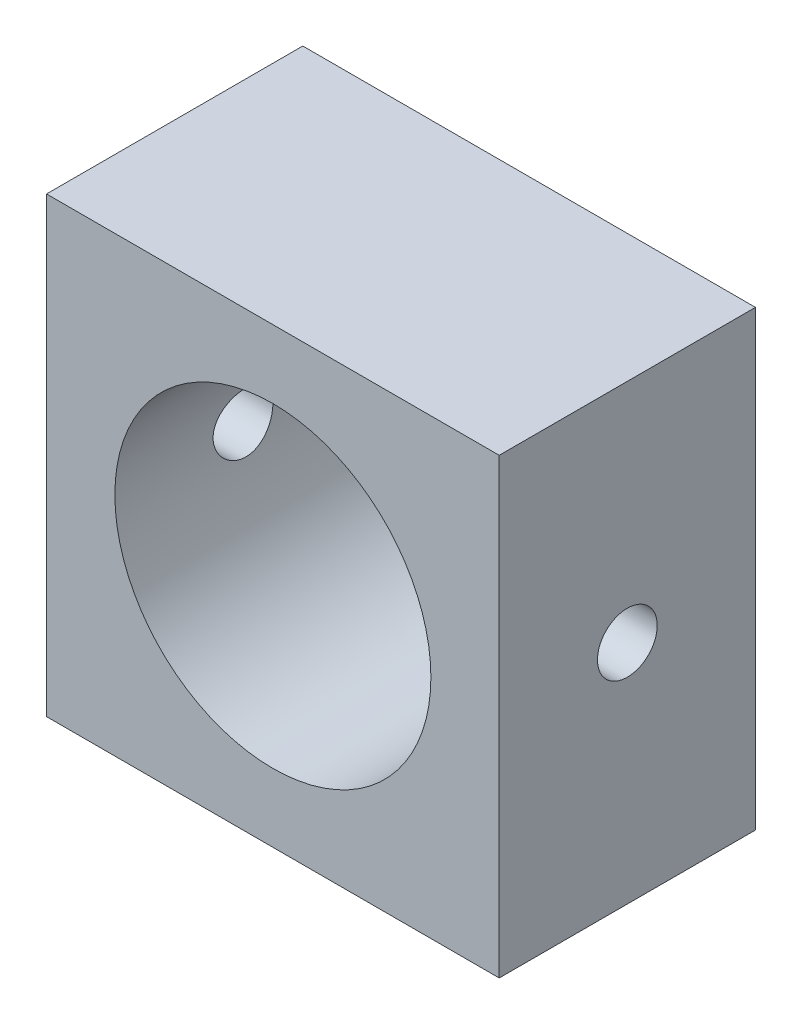
ISO-10303-21;
HEADER;
FILE_DESCRIPTION(('STEP AP214'),'2;1');
FILE_NAME('part.step','',(''),(''),'','','');
FILE_SCHEMA(('AUTOMOTIVE_DESIGN { 1 0 10303 214 1 1 1 1 }'));
ENDSEC;
DATA;
#1=APPLICATION_CONTEXT('core data for automotive mechanical design processes');
#2=APPLICATION_PROTOCOL_DEFINITION('international standard','automotive_design',2000,#1);
#3=PRODUCT_CONTEXT('',#1,'mechanical');
#4=PRODUCT('Part','Part','',(#3));
#5=PRODUCT_RELATED_PRODUCT_CATEGORY('part','',(#4));
#6=PRODUCT_DEFINITION_FORMATION('','',#4);
#7=PRODUCT_DEFINITION_CONTEXT('part definition',#1,'design');
#8=PRODUCT_DEFINITION('design','',#6,#7);
#9=PRODUCT_DEFINITION_SHAPE('','',#8);
#10=(LENGTH_UNIT() NAMED_UNIT(*) SI_UNIT(.MILLI.,.METRE.));
#11=(NAMED_UNIT(*) PLANE_ANGLE_UNIT() SI_UNIT($,.RADIAN.));
#12=(NAMED_UNIT(*) SI_UNIT($,.STERADIAN.) SOLID_ANGLE_UNIT());
#13=UNCERTAINTY_MEASURE_WITH_UNIT(LENGTH_MEASURE(1.E-05),#10,'distance_accuracy_value','');
#14=(GEOMETRIC_REPRESENTATION_CONTEXT(3) GLOBAL_UNCERTAINTY_ASSIGNED_CONTEXT((#13)) GLOBAL_UNIT_ASSIGNED_CONTEXT((#10,
#11,#12)) REPRESENTATION_CONTEXT('',''));
#15=CARTESIAN_POINT('',(0.,0.,0.));
#16=DIRECTION('',(0.,0.,1.));
#17=DIRECTION('',(1.,0.,0.));
#18=AXIS2_PLACEMENT_3D('',#15,#16,#17);
#19=CARTESIAN_POINT('',(0.,0.,7.5));
#20=DIRECTION('',(0.,0.,1.));
#21=DIRECTION('',(1.,0.,0.));
#22=AXIS2_PLACEMENT_3D('',#19,#20,#21);
#23=PLANE('',#22);
#24=DIRECTION('',(0.,1.,0.));
#25=VECTOR('',#24,1.);
#26=CARTESIAN_POINT('',(13.25,13.25,7.5));
#27=LINE('',#26,#25);
#28=CARTESIAN_POINT('',(13.25,-13.25,7.5));
#29=VERTEX_POINT('',#28);
#30=CARTESIAN_POINT('',(13.25,13.25,7.5));
#31=VERTEX_POINT('',#30);
#32=EDGE_CURVE('E92',#29,#31,#27,.T.);
#33=ORIENTED_EDGE('',*,*,#32,.T.);
#34=DIRECTION('',(-1.,0.,0.));
#35=VECTOR('',#34,1.);
#36=CARTESIAN_POINT('',(-13.25,13.25,7.5));
#37=LINE('',#36,#35);
#38=CARTESIAN_POINT('',(-13.25,13.25,7.5));
#39=VERTEX_POINT('',#38);
#40=EDGE_CURVE('E87',#31,#39,#37,.T.);
#41=ORIENTED_EDGE('',*,*,#40,.T.);
#42=DIRECTION('',(0.,-1.,0.));
#43=VECTOR('',#42,1.);
#44=CARTESIAN_POINT('',(-13.25,13.25,7.5));
#45=LINE('',#44,#43);
#46=CARTESIAN_POINT('',(-13.25,-13.25,7.5));
#47=VERTEX_POINT('',#46);
#48=EDGE_CURVE('E90',#39,#47,#45,.T.);
#49=ORIENTED_EDGE('',*,*,#48,.T.);
#50=DIRECTION('',(1.,0.,0.));
#51=VECTOR('',#50,1.);
#52=CARTESIAN_POINT('',(-13.25,-13.25,7.5));
#53=LINE('',#52,#51);
#54=EDGE_CURVE('E57',#47,#29,#53,.T.);
#55=ORIENTED_EDGE('',*,*,#54,.T.);
#56=EDGE_LOOP('',(#33,#41,#49,#55));
#57=FACE_BOUND('',#56,.T.);
#58=CARTESIAN_POINT('',(0.,0.,7.5));
#59=DIRECTION('',(0.,0.,1.));
#60=DIRECTION('',(1.,0.,0.));
#61=AXIS2_PLACEMENT_3D('',#58,#59,#60);
#62=CIRCLE('',#61,9.25);
#63=CARTESIAN_POINT('',(9.25,0.,7.5));
#64=VERTEX_POINT('',#63);
#65=EDGE_CURVE('E108',#64,#64,#62,.T.);
#66=ORIENTED_EDGE('',*,*,#65,.F.);
#67=EDGE_LOOP('',(#66));
#68=FACE_BOUND('',#67,.T.);
#69=ADVANCED_FACE('F33',(#57,#68),#23,.T.);
#70=CARTESIAN_POINT('',(0.,0.,-7.5));
#71=DIRECTION('',(0.,0.,1.));
#72=DIRECTION('',(1.,0.,0.));
#73=AXIS2_PLACEMENT_3D('',#70,#71,#72);
#74=PLANE('',#73);
#75=DIRECTION('',(0.,1.,0.));
#76=VECTOR('',#75,1.);
#77=CARTESIAN_POINT('',(13.25,13.25,-7.5));
#78=LINE('',#77,#76);
#79=CARTESIAN_POINT('',(13.25,-13.25,-7.5));
#80=VERTEX_POINT('',#79);
#81=CARTESIAN_POINT('',(13.25,13.25,-7.5));
#82=VERTEX_POINT('',#81);
#83=EDGE_CURVE('E105',#80,#82,#78,.T.);
#84=ORIENTED_EDGE('',*,*,#83,.F.);
#85=DIRECTION('',(1.,0.,0.));
#86=VECTOR('',#85,1.);
#87=CARTESIAN_POINT('',(-13.25,-13.25,-7.5));
#88=LINE('',#87,#86);
#89=CARTESIAN_POINT('',(-13.25,-13.25,-7.5));
#90=VERTEX_POINT('',#89);
#91=EDGE_CURVE('E80',#90,#80,#88,.T.);
#92=ORIENTED_EDGE('',*,*,#91,.F.);
#93=DIRECTION('',(0.,-1.,0.));
#94=VECTOR('',#93,1.);
#95=CARTESIAN_POINT('',(-13.25,13.25,-7.5));
#96=LINE('',#95,#94);
#97=CARTESIAN_POINT('',(-13.25,13.25,-7.5));
#98=VERTEX_POINT('',#97);
#99=EDGE_CURVE('E74',#98,#90,#96,.T.);
#100=ORIENTED_EDGE('',*,*,#99,.F.);
#101=DIRECTION('',(-1.,0.,0.));
#102=VECTOR('',#101,1.);
#103=CARTESIAN_POINT('',(-13.25,13.25,-7.5));
#104=LINE('',#103,#102);
#105=EDGE_CURVE('E96',#82,#98,#104,.T.);
#106=ORIENTED_EDGE('',*,*,#105,.F.);
#107=EDGE_LOOP('',(#84,#92,#100,#106));
#108=FACE_BOUND('',#107,.T.);
#109=CARTESIAN_POINT('',(0.,0.,-7.5));
#110=DIRECTION('',(0.,0.,1.));
#111=DIRECTION('',(1.,0.,0.));
#112=AXIS2_PLACEMENT_3D('',#109,#110,#111);
#113=CIRCLE('',#112,9.25);
#114=CARTESIAN_POINT('',(9.25,0.,-7.5));
#115=VERTEX_POINT('',#114);
#116=EDGE_CURVE('E163',#115,#115,#113,.T.);
#117=ORIENTED_EDGE('',*,*,#116,.T.);
#118=EDGE_LOOP('',(#117));
#119=FACE_BOUND('',#118,.T.);
#120=ADVANCED_FACE('F137',(#108,#119),#74,.F.);
#121=CARTESIAN_POINT('',(13.25,13.25,7.5));
#122=DIRECTION('',(-1.,0.,0.));
#123=DIRECTION('',(0.,0.,1.));
#124=AXIS2_PLACEMENT_3D('',#121,#122,#123);
#125=PLANE('',#124);
#126=CARTESIAN_POINT('',(13.25,0.,0.));
#127=DIRECTION('',(1.,0.,0.));
#128=DIRECTION('',(0.,0.,-1.));
#129=AXIS2_PLACEMENT_3D('',#126,#127,#128);
#130=CIRCLE('',#129,1.75);
#131=CARTESIAN_POINT('',(13.25,0.,-1.75));
#132=VERTEX_POINT('',#131);
#133=EDGE_CURVE('E158',#132,#132,#130,.T.);
#134=ORIENTED_EDGE('',*,*,#133,.F.);
#135=EDGE_LOOP('',(#134));
#136=FACE_BOUND('',#135,.T.);
#137=ORIENTED_EDGE('',*,*,#83,.T.);
#138=DIRECTION('',(0.,0.,-1.));
#139=VECTOR('',#138,1.);
#140=CARTESIAN_POINT('',(13.25,13.25,7.5));
#141=LINE('',#140,#139);
#142=EDGE_CURVE('E11',#31,#82,#141,.T.);
#143=ORIENTED_EDGE('',*,*,#142,.F.);
#144=ORIENTED_EDGE('',*,*,#32,.F.);
#145=DIRECTION('',(0.,0.,-1.));
#146=VECTOR('',#145,1.);
#147=CARTESIAN_POINT('',(13.25,-13.25,7.5));
#148=LINE('',#147,#146);
#149=EDGE_CURVE('E101',#29,#80,#148,.T.);
#150=ORIENTED_EDGE('',*,*,#149,.T.);
#151=EDGE_LOOP('',(#137,#143,#144,#150));
#152=FACE_BOUND('',#151,.T.);
#153=ADVANCED_FACE('F35',(#136,#152),#125,.F.);
#154=CARTESIAN_POINT('',(-13.25,13.25,7.5));
#155=DIRECTION('',(0.,-1.,0.));
#156=DIRECTION('',(0.,0.,-1.));
#157=AXIS2_PLACEMENT_3D('',#154,#155,#156);
#158=PLANE('',#157);
#159=ORIENTED_EDGE('',*,*,#105,.T.);
#160=DIRECTION('',(0.,0.,-1.));
#161=VECTOR('',#160,1.);
#162=CARTESIAN_POINT('',(-13.25,13.25,7.5));
#163=LINE('',#162,#161);
#164=EDGE_CURVE('E48',#39,#98,#163,.T.);
#165=ORIENTED_EDGE('',*,*,#164,.F.);
#166=ORIENTED_EDGE('',*,*,#40,.F.);
#167=ORIENTED_EDGE('',*,*,#142,.T.);
#168=EDGE_LOOP('',(#159,#165,#166,#167));
#169=FACE_BOUND('',#168,.T.);
#170=ADVANCED_FACE('F95',(#169),#158,.F.);
#171=CARTESIAN_POINT('',(-13.25,13.25,7.5));
#172=DIRECTION('',(1.,0.,0.));
#173=DIRECTION('',(0.,0.,-1.));
#174=AXIS2_PLACEMENT_3D('',#171,#172,#173);
#175=PLANE('',#174);
#176=CARTESIAN_POINT('',(-13.25,0.,0.));
#177=DIRECTION('',(1.,0.,0.));
#178=DIRECTION('',(0.,0.,-1.));
#179=AXIS2_PLACEMENT_3D('',#176,#177,#178);
#180=CIRCLE('',#179,1.75);
#181=CARTESIAN_POINT('',(-13.25,0.,-1.75));
#182=VERTEX_POINT('',#181);
#183=EDGE_CURVE('E118',#182,#182,#180,.T.);
#184=ORIENTED_EDGE('',*,*,#183,.T.);
#185=EDGE_LOOP('',(#184));
#186=FACE_BOUND('',#185,.T.);
#187=ORIENTED_EDGE('',*,*,#99,.T.);
#188=DIRECTION('',(0.,0.,-1.));
#189=VECTOR('',#188,1.);
#190=CARTESIAN_POINT('',(-13.25,-13.25,7.5));
#191=LINE('',#190,#189);
#192=EDGE_CURVE('E97',#47,#90,#191,.T.);
#193=ORIENTED_EDGE('',*,*,#192,.F.);
#194=ORIENTED_EDGE('',*,*,#48,.F.);
#195=ORIENTED_EDGE('',*,*,#164,.T.);
#196=EDGE_LOOP('',(#187,#193,#194,#195));
#197=FACE_BOUND('',#196,.T.);
#198=ADVANCED_FACE('F99',(#186,#197),#175,.F.);
#199=CARTESIAN_POINT('',(-13.25,-13.25,7.5));
#200=DIRECTION('',(0.,1.,0.));
#201=DIRECTION('',(0.,0.,1.));
#202=AXIS2_PLACEMENT_3D('',#199,#200,#201);
#203=PLANE('',#202);
#204=ORIENTED_EDGE('',*,*,#91,.T.);
#205=ORIENTED_EDGE('',*,*,#149,.F.);
#206=ORIENTED_EDGE('',*,*,#54,.F.);
#207=ORIENTED_EDGE('',*,*,#192,.T.);
#208=EDGE_LOOP('',(#204,#205,#206,#207));
#209=FACE_BOUND('',#208,.T.);
#210=ADVANCED_FACE('F133',(#209),#203,.F.);
#211=CARTESIAN_POINT('',(0.,0.,7.5));
#212=DIRECTION('',(0.,0.,-1.));
#213=DIRECTION('',(-1.,0.,0.));
#214=AXIS2_PLACEMENT_3D('',#211,#212,#213);
#215=CYLINDRICAL_SURFACE('',#214,9.25);
#216=CARTESIAN_POINT('',(-9.25,0.,1.75));
#217=CARTESIAN_POINT('',(-9.24999823125548,-0.09736737410686,1.74999629681898));
#218=CARTESIAN_POINT('',(-9.24844677627382,-0.194782746797271,1.74184647915802));
#219=CARTESIAN_POINT('',(-9.24240726812203,-0.386867274099822,1.70948417352548));
#220=CARTESIAN_POINT('',(-9.23791675572853,-0.481534059523615,1.68525823380294));
#221=CARTESIAN_POINT('',(-9.22650133596264,-0.665315772169169,1.62151292171138));
#222=CARTESIAN_POINT('',(-9.21957864523764,-0.75443566796708,1.58200747154169));
#223=CARTESIAN_POINT('',(-9.20405437161695,-0.924774401957625,1.48886431684562));
#224=CARTESIAN_POINT('',(-9.19545291987819,-1.00599385664738,1.43522771623213));
#225=CARTESIAN_POINT('',(-9.17740299366017,-1.15922356293248,1.31465130514928));
#226=CARTESIAN_POINT('',(-9.16794630092579,-1.23112365721158,1.24757272157401));
#227=CARTESIAN_POINT('',(-9.14931255735231,-1.36272057984925,1.10231495105962));
#228=CARTESIAN_POINT('',(-9.14013552686678,-1.42241652179654,1.02413495850198));
#229=CARTESIAN_POINT('',(-9.12302023123853,-1.52837017163527,0.858113295637288));
#230=CARTESIAN_POINT('',(-9.11509255928407,-1.5745155587981,0.770198754936299));
#231=CARTESIAN_POINT('',(-9.10148949514681,-1.65133909801847,0.587689949445606));
#232=CARTESIAN_POINT('',(-9.09581390505438,-1.68201860925846,0.493096272469496));
#233=CARTESIAN_POINT('',(-9.08744038580339,-1.72668544696234,0.301093895419485));
#234=CARTESIAN_POINT('',(-9.08470818760882,-1.74086503649206,0.203731447081515));
#235=CARTESIAN_POINT('',(-9.08242750404155,-1.75272635231104,0.00797402851494357));
#236=CARTESIAN_POINT('',(-9.08287872793016,-1.7504095851955,-0.0904208466036329));
#237=CARTESIAN_POINT('',(-9.08688271434823,-1.72949979317179,-0.284055322595028));
#238=CARTESIAN_POINT('',(-9.09039377016973,-1.71112562755412,-0.379319547147175));
#239=CARTESIAN_POINT('',(-9.10005628147934,-1.65896738817847,-0.565388378838642));
#240=CARTESIAN_POINT('',(-9.10620785100532,-1.62518264886834,-0.656192793179965));
#241=CARTESIAN_POINT('',(-9.12050173505053,-1.5429489173118,-0.831403501359827));
#242=CARTESIAN_POINT('',(-9.12865595930717,-1.49441176675989,-0.915767407057075));
#243=CARTESIAN_POINT('',(-9.14602853184499,-1.38411333339808,-1.0752356688273));
#244=CARTESIAN_POINT('',(-9.15524698996583,-1.32235068502034,-1.15033906746546));
#245=CARTESIAN_POINT('',(-9.17389093149048,-1.186175556571,-1.29041869969014));
#246=CARTESIAN_POINT('',(-9.18331736274488,-1.11157593203626,-1.35521301621372));
#247=CARTESIAN_POINT('',(-9.20117920155884,-0.95247011393088,-1.4713951844625));
#248=CARTESIAN_POINT('',(-9.20961459883742,-0.867963817606796,-1.52278289711461));
#249=CARTESIAN_POINT('',(-9.22456142613278,-0.691252096995397,-1.61072085173797));
#250=CARTESIAN_POINT('',(-9.23107036780633,-0.599036910728522,-1.64725192642224));
#251=CARTESIAN_POINT('',(-9.24141172025686,-0.409628301241633,-1.70425437533158));
#252=CARTESIAN_POINT('',(-9.24524442058732,-0.312435417800679,-1.72472748696274));
#253=CARTESIAN_POINT('',(-9.24976160304379,-0.117395222384289,-1.74877907156706));
#254=CARTESIAN_POINT('',(-9.25049252095568,-0.0195796834224176,-1.75260675952568));
#255=CARTESIAN_POINT('',(-9.24885214719643,0.175293680863019,-1.74392768919436));
#256=CARTESIAN_POINT('',(-9.24648101081659,0.272351543871769,-1.73142174857897));
#257=CARTESIAN_POINT('',(-9.23893188809867,0.462162186696269,-1.69063759554731));
#258=CARTESIAN_POINT('',(-9.23377639375811,0.554943084488435,-1.66248571850379));
#259=CARTESIAN_POINT('',(-9.22123428019228,0.73446803191152,-1.59134571123303));
#260=CARTESIAN_POINT('',(-9.21384750736094,0.821211665418042,-1.54835655954652));
#261=CARTESIAN_POINT('',(-9.19754638812607,0.987261685682193,-1.44821235996764));
#262=CARTESIAN_POINT('',(-9.1886159916582,1.06647480301347,-1.39090532738362));
#263=CARTESIAN_POINT('',(-9.17025915171629,1.2142495281884,-1.26395747987956));
#264=CARTESIAN_POINT('',(-9.16083266108597,1.28281012099828,-1.19431549096529));
#265=CARTESIAN_POINT('',(-9.1423916792123,1.40828254732185,-1.0435455301342));
#266=CARTESIAN_POINT('',(-9.13338449046999,1.4650241711953,-0.96227486521675));
#267=CARTESIAN_POINT('',(-9.11694992344786,1.56405057010605,-0.791209155727477));
#268=CARTESIAN_POINT('',(-9.10952248581521,1.60633588831747,-0.701414431596474));
#269=CARTESIAN_POINT('',(-9.09714591605472,1.67500920950056,-0.516277893102516));
#270=CARTESIAN_POINT('',(-9.09218473238565,1.70147464872524,-0.420965645842266));
#271=CARTESIAN_POINT('',(-9.08527512182017,1.7379952633258,-0.227144471854335));
#272=CARTESIAN_POINT('',(-9.08332634813914,1.74805232761938,-0.128635914414851));
#273=CARTESIAN_POINT('',(-9.08268001411537,1.75140661578233,0.0670761207815632));
#274=CARTESIAN_POINT('',(-9.08393035778145,1.74497238891173,0.1642749250305));
#275=CARTESIAN_POINT('',(-9.08942574284728,1.71611531033506,0.35617866380271));
#276=CARTESIAN_POINT('',(-9.09367076558154,1.69369255828353,0.450883613866061));
#277=CARTESIAN_POINT('',(-9.10465508321766,1.63360910153008,0.634963379949341));
#278=CARTESIAN_POINT('',(-9.11138953269099,1.59597798525119,0.724348161345213));
#279=CARTESIAN_POINT('',(-9.12659723831686,1.50657556799169,0.895578210294066));
#280=CARTESIAN_POINT('',(-9.13507062036614,1.45480324311374,0.977422931333242));
#281=CARTESIAN_POINT('',(-9.15296286432341,1.3376565630408,1.13259374847186));
#282=CARTESIAN_POINT('',(-9.162394165926,1.27208696210846,1.20577103428155));
#283=CARTESIAN_POINT('',(-9.18104701516665,1.12961360852404,1.34017365664908));
#284=CARTESIAN_POINT('',(-9.19026851412604,1.05270725584743,1.40139624395193));
#285=CARTESIAN_POINT('',(-9.20756223536757,0.888896246431685,1.51067804798256));
#286=CARTESIAN_POINT('',(-9.21562311506056,0.801906187960267,1.55861110186062));
#287=CARTESIAN_POINT('',(-9.22957648363049,0.620982362862959,1.63910498917436));
#288=CARTESIAN_POINT('',(-9.23547099730595,0.527055179174858,1.67168018496065));
#289=CARTESIAN_POINT('',(-9.24323316782728,0.360716916412462,1.7139595821338));
#290=CARTESIAN_POINT('',(-9.24575633100457,0.289275027389345,1.72745151024539));
#291=CARTESIAN_POINT('',(-9.24914038497553,0.145230974152857,1.74547298283551));
#292=CARTESIAN_POINT('',(-9.25000131935224,0.0726288404110132,1.75000276229842));
#293=CARTESIAN_POINT('',(-9.25,0.,1.75));
#294=B_SPLINE_CURVE_WITH_KNOTS('',3,(#216,#217,#218,#219,#220,#221,#222,#223,#224,#225,#226,
#227,#228,#229,#230,#231,#232,#233,#234,#235,#236,#237,#238,#239,#240,#241,#242,#243,#244,#245,
#246,#247,#248,#249,#250,#251,#252,#253,#254,#255,#256,#257,#258,#259,#260,#261,#262,#263,#264,
#265,#266,#267,#268,#269,#270,#271,#272,#273,#274,#275,#276,#277,#278,#279,#280,#281,#282,#283,
#284,#285,#286,#287,#288,#289,#290,#291,#292,#293),.UNSPECIFIED.,.T.,.F.,(4,2,2,2,2,2,2,2,2,2,2,
2,2,2,2,2,2,2,2,2,2,2,2,2,2,2,2,2,2,2,2,2,2,2,2,2,2,2,4),(0.,0.291836502198029,
0.583917508039883,0.875733003646942,1.16752570964328,1.46250233940604,1.75750038628825,
2.05487879062453,2.35223105599502,2.64608262548805,2.93990735816516,3.22978869911839,
3.51968256065784,3.81134403218266,4.10303563306395,4.39940956440229,4.69578657004649,
4.99254474255271,5.28927080260441,5.58153864733889,5.87379186147137,6.16371881883477,
6.45366573994988,6.74683194837853,7.04002607426002,7.33718822747895,7.6343392140457,
7.93002351423992,8.22567377311509,8.51654026859331,8.80740495115153,9.09770644938105,
9.38802897252964,9.68277541482094,9.97758956113869,10.2751134797171,10.5723586054612,
10.7900527017192,11.0077410900389),.UNSPECIFIED.);
#295=CARTESIAN_POINT('',(-9.25,0.,1.75));
#296=VERTEX_POINT('',#295);
#297=EDGE_CURVE('E37',#296,#296,#294,.T.);
#298=ORIENTED_EDGE('',*,*,#297,.F.);
#299=EDGE_LOOP('',(#298));
#300=FACE_BOUND('',#299,.T.);
#301=CARTESIAN_POINT('',(9.25,0.,-1.75));
#302=CARTESIAN_POINT('',(9.24999823125548,-0.09736737410686,-1.74999629681898));
#303=CARTESIAN_POINT('',(9.24844677627382,-0.194782746797271,-1.74184647915802));
#304=CARTESIAN_POINT('',(9.24240726812203,-0.386867274099822,-1.70948417352548));
#305=CARTESIAN_POINT('',(9.23791675572853,-0.481534059523615,-1.68525823380294));
#306=CARTESIAN_POINT('',(9.22650133596264,-0.665315772169169,-1.62151292171138));
#307=CARTESIAN_POINT('',(9.21957864523764,-0.75443566796708,-1.58200747154169));
#308=CARTESIAN_POINT('',(9.20405437161695,-0.924774401957625,-1.48886431684562));
#309=CARTESIAN_POINT('',(9.19545291987819,-1.00599385664738,-1.43522771623213));
#310=CARTESIAN_POINT('',(9.17740299366017,-1.15922356293248,-1.31465130514928));
#311=CARTESIAN_POINT('',(9.16794630092579,-1.23112365721158,-1.24757272157401));
#312=CARTESIAN_POINT('',(9.14931255735231,-1.36272057984925,-1.10231495105962));
#313=CARTESIAN_POINT('',(9.14013552686678,-1.42241652179654,-1.02413495850198));
#314=CARTESIAN_POINT('',(9.12302023123853,-1.52837017163527,-0.858113295637288));
#315=CARTESIAN_POINT('',(9.11509255928407,-1.5745155587981,-0.770198754936299));
#316=CARTESIAN_POINT('',(9.10148949514681,-1.65133909801847,-0.587689949445606));
#317=CARTESIAN_POINT('',(9.09581390505438,-1.68201860925846,-0.493096272469496));
#318=CARTESIAN_POINT('',(9.08744038580339,-1.72668544696234,-0.301093895419485));
#319=CARTESIAN_POINT('',(9.08470818760882,-1.74086503649206,-0.203731447081515));
#320=CARTESIAN_POINT('',(9.08242750404155,-1.75272635231104,-0.00797402851494357));
#321=CARTESIAN_POINT('',(9.08287872793016,-1.7504095851955,0.0904208466036329));
#322=CARTESIAN_POINT('',(9.08688271434823,-1.72949979317179,0.284055322595028));
#323=CARTESIAN_POINT('',(9.09039377016973,-1.71112562755412,0.379319547147175));
#324=CARTESIAN_POINT('',(9.10005628147934,-1.65896738817847,0.565388378838642));
#325=CARTESIAN_POINT('',(9.10620785100532,-1.62518264886834,0.656192793179965));
#326=CARTESIAN_POINT('',(9.12050173505053,-1.5429489173118,0.831403501359827));
#327=CARTESIAN_POINT('',(9.12865595930717,-1.49441176675989,0.915767407057075));
#328=CARTESIAN_POINT('',(9.14602853184499,-1.38411333339808,1.0752356688273));
#329=CARTESIAN_POINT('',(9.15524698996583,-1.32235068502034,1.15033906746546));
#330=CARTESIAN_POINT('',(9.17389093149048,-1.186175556571,1.29041869969014));
#331=CARTESIAN_POINT('',(9.18331736274488,-1.11157593203626,1.35521301621372));
#332=CARTESIAN_POINT('',(9.20117920155884,-0.95247011393088,1.4713951844625));
#333=CARTESIAN_POINT('',(9.20961459883742,-0.867963817606796,1.52278289711461));
#334=CARTESIAN_POINT('',(9.22456142613278,-0.691252096995397,1.61072085173797));
#335=CARTESIAN_POINT('',(9.23107036780633,-0.599036910728522,1.64725192642224));
#336=CARTESIAN_POINT('',(9.24141172025686,-0.409628301241633,1.70425437533158));
#337=CARTESIAN_POINT('',(9.24524442058732,-0.312435417800679,1.72472748696274));
#338=CARTESIAN_POINT('',(9.24976160304379,-0.117395222384289,1.74877907156706));
#339=CARTESIAN_POINT('',(9.25049252095568,-0.0195796834224176,1.75260675952568));
#340=CARTESIAN_POINT('',(9.24885214719643,0.175293680863019,1.74392768919436));
#341=CARTESIAN_POINT('',(9.24648101081659,0.272351543871769,1.73142174857897));
#342=CARTESIAN_POINT('',(9.23893188809867,0.462162186696269,1.69063759554731));
#343=CARTESIAN_POINT('',(9.23377639375811,0.554943084488435,1.66248571850379));
#344=CARTESIAN_POINT('',(9.22123428019228,0.73446803191152,1.59134571123303));
#345=CARTESIAN_POINT('',(9.21384750736094,0.821211665418042,1.54835655954652));
#346=CARTESIAN_POINT('',(9.19754638812607,0.987261685682193,1.44821235996764));
#347=CARTESIAN_POINT('',(9.1886159916582,1.06647480301347,1.39090532738362));
#348=CARTESIAN_POINT('',(9.17025915171629,1.2142495281884,1.26395747987956));
#349=CARTESIAN_POINT('',(9.16083266108597,1.28281012099828,1.19431549096529));
#350=CARTESIAN_POINT('',(9.1423916792123,1.40828254732185,1.0435455301342));
#351=CARTESIAN_POINT('',(9.13338449046999,1.4650241711953,0.96227486521675));
#352=CARTESIAN_POINT('',(9.11694992344786,1.56405057010605,0.791209155727477));
#353=CARTESIAN_POINT('',(9.10952248581521,1.60633588831747,0.701414431596474));
#354=CARTESIAN_POINT('',(9.09714591605472,1.67500920950056,0.516277893102516));
#355=CARTESIAN_POINT('',(9.09218473238565,1.70147464872524,0.420965645842266));
#356=CARTESIAN_POINT('',(9.08527512182017,1.7379952633258,0.227144471854335));
#357=CARTESIAN_POINT('',(9.08332634813914,1.74805232761938,0.128635914414851));
#358=CARTESIAN_POINT('',(9.08268001411537,1.75140661578233,-0.0670761207815632));
#359=CARTESIAN_POINT('',(9.08393035778145,1.74497238891173,-0.1642749250305));
#360=CARTESIAN_POINT('',(9.08942574284728,1.71611531033506,-0.35617866380271));
#361=CARTESIAN_POINT('',(9.09367076558154,1.69369255828353,-0.450883613866061));
#362=CARTESIAN_POINT('',(9.10465508321766,1.63360910153008,-0.634963379949341));
#363=CARTESIAN_POINT('',(9.11138953269099,1.59597798525119,-0.724348161345213));
#364=CARTESIAN_POINT('',(9.12659723831686,1.50657556799169,-0.895578210294066));
#365=CARTESIAN_POINT('',(9.13507062036614,1.45480324311374,-0.977422931333242));
#366=CARTESIAN_POINT('',(9.15296286432341,1.3376565630408,-1.13259374847186));
#367=CARTESIAN_POINT('',(9.162394165926,1.27208696210846,-1.20577103428155));
#368=CARTESIAN_POINT('',(9.18104701516665,1.12961360852404,-1.34017365664908));
#369=CARTESIAN_POINT('',(9.19026851412604,1.05270725584743,-1.40139624395193));
#370=CARTESIAN_POINT('',(9.20756223536757,0.888896246431685,-1.51067804798256));
#371=CARTESIAN_POINT('',(9.21562311506056,0.801906187960267,-1.55861110186062));
#372=CARTESIAN_POINT('',(9.22957648363049,0.620982362862959,-1.63910498917436));
#373=CARTESIAN_POINT('',(9.23547099730595,0.527055179174858,-1.67168018496065));
#374=CARTESIAN_POINT('',(9.24323316782728,0.360716916412462,-1.7139595821338));
#375=CARTESIAN_POINT('',(9.24575633100457,0.289275027389345,-1.72745151024539));
#376=CARTESIAN_POINT('',(9.24914038497553,0.145230974152857,-1.74547298283551));
#377=CARTESIAN_POINT('',(9.25000131935224,0.0726288404110132,-1.75000276229842));
#378=CARTESIAN_POINT('',(9.25,0.,-1.75));
#379=B_SPLINE_CURVE_WITH_KNOTS('',3,(#301,#302,#303,#304,#305,#306,#307,#308,#309,#310,#311,
#312,#313,#314,#315,#316,#317,#318,#319,#320,#321,#322,#323,#324,#325,#326,#327,#328,#329,#330,
#331,#332,#333,#334,#335,#336,#337,#338,#339,#340,#341,#342,#343,#344,#345,#346,#347,#348,#349,
#350,#351,#352,#353,#354,#355,#356,#357,#358,#359,#360,#361,#362,#363,#364,#365,#366,#367,#368,
#369,#370,#371,#372,#373,#374,#375,#376,#377,#378),.UNSPECIFIED.,.T.,.F.,(4,2,2,2,2,2,2,2,2,2,2,
2,2,2,2,2,2,2,2,2,2,2,2,2,2,2,2,2,2,2,2,2,2,2,2,2,2,2,4),(0.,0.291836502198029,
0.583917508039883,0.875733003646942,1.16752570964328,1.46250233940604,1.75750038628825,
2.05487879062453,2.35223105599502,2.64608262548805,2.93990735816516,3.22978869911839,
3.51968256065784,3.81134403218266,4.10303563306395,4.39940956440229,4.69578657004649,
4.99254474255271,5.28927080260441,5.58153864733889,5.87379186147137,6.16371881883477,
6.45366573994988,6.74683194837853,7.04002607426002,7.33718822747895,7.6343392140457,
7.93002351423992,8.22567377311509,8.51654026859331,8.80740495115153,9.09770644938105,
9.38802897252964,9.68277541482094,9.97758956113869,10.2751134797171,10.5723586054612,
10.7900527017192,11.0077410900389),.UNSPECIFIED.);
#380=CARTESIAN_POINT('',(9.25,0.,-1.75));
#381=VERTEX_POINT('',#380);
#382=EDGE_CURVE('E113',#381,#381,#379,.T.);
#383=ORIENTED_EDGE('',*,*,#382,.F.);
#384=EDGE_LOOP('',(#383));
#385=FACE_BOUND('',#384,.T.);
#386=ORIENTED_EDGE('',*,*,#65,.T.);
#387=EDGE_LOOP('',(#386));
#388=FACE_BOUND('',#387,.T.);
#389=ORIENTED_EDGE('',*,*,#116,.F.);
#390=EDGE_LOOP('',(#389));
#391=FACE_BOUND('',#390,.T.);
#392=ADVANCED_FACE('F119',(#300,#385,#388,#391),#215,.F.);
#393=CARTESIAN_POINT('',(-13.25,0.,0.));
#394=DIRECTION('',(1.,0.,0.));
#395=DIRECTION('',(0.,0.,-1.));
#396=AXIS2_PLACEMENT_3D('',#393,#394,#395);
#397=CYLINDRICAL_SURFACE('',#396,1.75);
#398=ORIENTED_EDGE('',*,*,#382,.T.);
#399=EDGE_LOOP('',(#398));
#400=FACE_BOUND('',#399,.T.);
#401=ORIENTED_EDGE('',*,*,#133,.T.);
#402=EDGE_LOOP('',(#401));
#403=FACE_BOUND('',#402,.T.);
#404=ADVANCED_FACE('F122',(#400,#403),#397,.F.);
#405=ORIENTED_EDGE('',*,*,#297,.T.);
#406=EDGE_LOOP('',(#405));
#407=FACE_BOUND('',#406,.T.);
#408=ORIENTED_EDGE('',*,*,#183,.F.);
#409=EDGE_LOOP('',(#408));
#410=FACE_BOUND('',#409,.T.);
#411=ADVANCED_FACE('F125',(#407,#410),#397,.F.);
#412=CLOSED_SHELL('',(#69,#120,#153,#170,#198,#210,#392,#404,#411));
#413=MANIFOLD_SOLID_BREP('B2',#412);
#414=ADVANCED_BREP_SHAPE_REPRESENTATION('',(#18,#413),#14);
#415=SHAPE_DEFINITION_REPRESENTATION(#9,#414);
ENDSEC;
END-ISO-10303-21;
